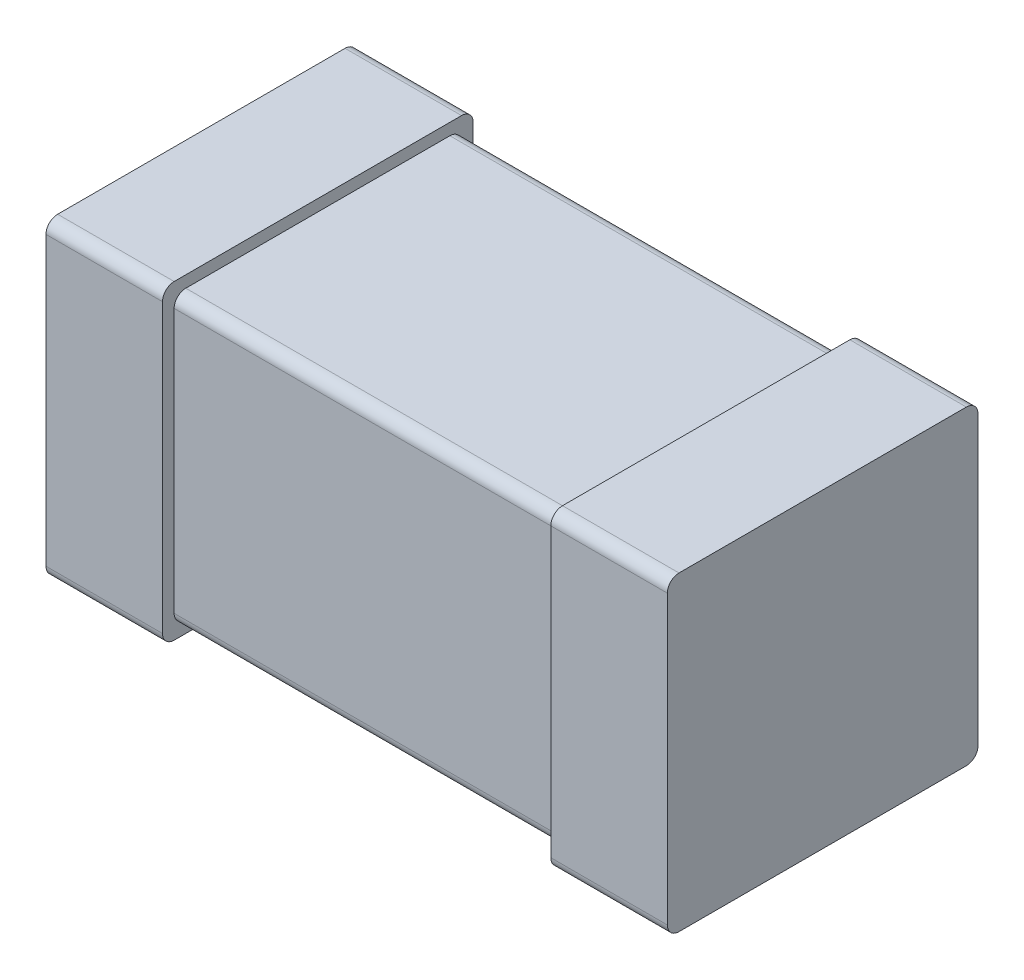
ISO-10303-21;
HEADER;
FILE_DESCRIPTION(('STEP AP214'),'2;1');
FILE_NAME('part.step','',(''),(''),'','','');
FILE_SCHEMA(('AUTOMOTIVE_DESIGN { 1 0 10303 214 1 1 1 1 }'));
ENDSEC;
DATA;
#1=APPLICATION_CONTEXT('core data for automotive mechanical design processes');
#2=APPLICATION_PROTOCOL_DEFINITION('international standard','automotive_design',2000,#1);
#3=PRODUCT_CONTEXT('',#1,'mechanical');
#4=PRODUCT('Part','Part','',(#3));
#5=PRODUCT_RELATED_PRODUCT_CATEGORY('part','',(#4));
#6=PRODUCT_DEFINITION_FORMATION('','',#4);
#7=PRODUCT_DEFINITION_CONTEXT('part definition',#1,'design');
#8=PRODUCT_DEFINITION('design','',#6,#7);
#9=PRODUCT_DEFINITION_SHAPE('','',#8);
#10=(LENGTH_UNIT() NAMED_UNIT(*) SI_UNIT(.MILLI.,.METRE.));
#11=(NAMED_UNIT(*) PLANE_ANGLE_UNIT() SI_UNIT($,.RADIAN.));
#12=(NAMED_UNIT(*) SI_UNIT($,.STERADIAN.) SOLID_ANGLE_UNIT());
#13=UNCERTAINTY_MEASURE_WITH_UNIT(LENGTH_MEASURE(1.E-05),#10,'distance_accuracy_value','');
#14=(GEOMETRIC_REPRESENTATION_CONTEXT(3) GLOBAL_UNCERTAINTY_ASSIGNED_CONTEXT((#13)) GLOBAL_UNIT_ASSIGNED_CONTEXT((#10,
#11,#12)) REPRESENTATION_CONTEXT('',''));
#15=CARTESIAN_POINT('',(0.,0.,0.));
#16=DIRECTION('',(0.,0.,1.));
#17=DIRECTION('',(1.,0.,0.));
#18=AXIS2_PLACEMENT_3D('',#15,#16,#17);
#19=CARTESIAN_POINT('',(0.8,-0.4,0.));
#20=DIRECTION('',(1.,0.,0.));
#21=DIRECTION('',(0.,1.,0.));
#22=AXIS2_PLACEMENT_3D('',#19,#20,#21);
#23=PLANE('',#22);
#24=DIRECTION('',(0.,0.,1.));
#25=VECTOR('',#24,1.);
#26=CARTESIAN_POINT('',(0.8,-0.4,0.));
#27=LINE('',#26,#25);
#28=CARTESIAN_POINT('',(0.8,-0.4,0.03));
#29=VERTEX_POINT('',#28);
#30=CARTESIAN_POINT('',(0.8,-0.4,0.77));
#31=VERTEX_POINT('',#30);
#32=EDGE_CURVE('E271',#29,#31,#27,.T.);
#33=ORIENTED_EDGE('',*,*,#32,.F.);
#34=CARTESIAN_POINT('',(0.8,-0.37,0.03));
#35=DIRECTION('',(1.,0.,0.));
#36=DIRECTION('',(0.,0.,1.));
#37=AXIS2_PLACEMENT_3D('',#34,#35,#36);
#38=CIRCLE('',#37,0.03);
#39=CARTESIAN_POINT('',(0.8,-0.37,0.));
#40=VERTEX_POINT('',#39);
#41=EDGE_CURVE('E248',#29,#40,#38,.T.);
#42=ORIENTED_EDGE('',*,*,#41,.T.);
#43=DIRECTION('',(0.,1.,0.));
#44=VECTOR('',#43,1.);
#45=CARTESIAN_POINT('',(0.8,-0.4,0.));
#46=LINE('',#45,#44);
#47=CARTESIAN_POINT('',(0.8,0.37,0.));
#48=VERTEX_POINT('',#47);
#49=EDGE_CURVE('E233',#40,#48,#46,.T.);
#50=ORIENTED_EDGE('',*,*,#49,.T.);
#51=CARTESIAN_POINT('',(0.8,0.37,0.03));
#52=DIRECTION('',(-1.,0.,0.));
#53=DIRECTION('',(0.,0.,1.));
#54=AXIS2_PLACEMENT_3D('',#51,#52,#53);
#55=CIRCLE('',#54,0.03);
#56=CARTESIAN_POINT('',(0.8,0.4,0.03));
#57=VERTEX_POINT('',#56);
#58=EDGE_CURVE('E277',#57,#48,#55,.T.);
#59=ORIENTED_EDGE('',*,*,#58,.F.);
#60=DIRECTION('',(0.,0.,1.));
#61=VECTOR('',#60,1.);
#62=CARTESIAN_POINT('',(0.8,0.4,0.));
#63=LINE('',#62,#61);
#64=CARTESIAN_POINT('',(0.8,0.4,0.77));
#65=VERTEX_POINT('',#64);
#66=EDGE_CURVE('E11',#57,#65,#63,.T.);
#67=ORIENTED_EDGE('',*,*,#66,.T.);
#68=CARTESIAN_POINT('',(0.8,0.37,0.77));
#69=DIRECTION('',(1.,0.,0.));
#70=DIRECTION('',(0.,0.,1.));
#71=AXIS2_PLACEMENT_3D('',#68,#69,#70);
#72=CIRCLE('',#71,0.03);
#73=CARTESIAN_POINT('',(0.8,0.37,0.8));
#74=VERTEX_POINT('',#73);
#75=EDGE_CURVE('E279',#65,#74,#72,.T.);
#76=ORIENTED_EDGE('',*,*,#75,.T.);
#77=DIRECTION('',(0.,1.,0.));
#78=VECTOR('',#77,1.);
#79=CARTESIAN_POINT('',(0.8,-0.4,0.8));
#80=LINE('',#79,#78);
#81=CARTESIAN_POINT('',(0.8,-0.37,0.8));
#82=VERTEX_POINT('',#81);
#83=EDGE_CURVE('E329',#82,#74,#80,.T.);
#84=ORIENTED_EDGE('',*,*,#83,.F.);
#85=CARTESIAN_POINT('',(0.8,-0.37,0.77));
#86=DIRECTION('',(-1.,0.,0.));
#87=DIRECTION('',(0.,0.,1.));
#88=AXIS2_PLACEMENT_3D('',#85,#86,#87);
#89=CIRCLE('',#88,0.03);
#90=EDGE_CURVE('E243',#31,#82,#89,.T.);
#91=ORIENTED_EDGE('',*,*,#90,.F.);
#92=EDGE_LOOP('',(#33,#42,#50,#59,#67,#76,#84,#91));
#93=FACE_BOUND('',#92,.T.);
#94=ADVANCED_FACE('F16',(#93),#23,.T.);
#95=CARTESIAN_POINT('',(0.5,0.4,0.));
#96=DIRECTION('',(0.,1.,0.));
#97=DIRECTION('',(1.,0.,0.));
#98=AXIS2_PLACEMENT_3D('',#95,#96,#97);
#99=PLANE('',#98);
#100=ORIENTED_EDGE('',*,*,#66,.F.);
#101=DIRECTION('',(1.,0.,0.));
#102=VECTOR('',#101,1.);
#103=CARTESIAN_POINT('',(0.5,0.4,0.03));
#104=LINE('',#103,#102);
#105=CARTESIAN_POINT('',(0.5,0.4,0.03));
#106=VERTEX_POINT('',#105);
#107=EDGE_CURVE('E280',#106,#57,#104,.T.);
#108=ORIENTED_EDGE('',*,*,#107,.F.);
#109=DIRECTION('',(0.,0.,1.));
#110=VECTOR('',#109,1.);
#111=CARTESIAN_POINT('',(0.5,0.4,0.));
#112=LINE('',#111,#110);
#113=CARTESIAN_POINT('',(0.5,0.4,0.77));
#114=VERTEX_POINT('',#113);
#115=EDGE_CURVE('E312',#106,#114,#112,.T.);
#116=ORIENTED_EDGE('',*,*,#115,.T.);
#117=DIRECTION('',(1.,0.,0.));
#118=VECTOR('',#117,1.);
#119=CARTESIAN_POINT('',(0.5,0.4,0.77));
#120=LINE('',#119,#118);
#121=EDGE_CURVE('E27',#114,#65,#120,.T.);
#122=ORIENTED_EDGE('',*,*,#121,.T.);
#123=EDGE_LOOP('',(#100,#108,#116,#122));
#124=FACE_BOUND('',#123,.T.);
#125=ADVANCED_FACE('F538',(#124),#99,.T.);
#126=CARTESIAN_POINT('',(0.5,0.37,0.77));
#127=DIRECTION('',(1.,0.,0.));
#128=DIRECTION('',(0.,1.,0.));
#129=AXIS2_PLACEMENT_3D('',#126,#127,#128);
#130=CYLINDRICAL_SURFACE('',#129,0.03);
#131=CARTESIAN_POINT('',(0.5,0.37,0.77));
#132=DIRECTION('',(1.,0.,0.));
#133=DIRECTION('',(0.,0.,1.));
#134=AXIS2_PLACEMENT_3D('',#131,#132,#133);
#135=CIRCLE('',#134,0.03);
#136=CARTESIAN_POINT('',(0.5,0.37,0.8));
#137=VERTEX_POINT('',#136);
#138=EDGE_CURVE('E430',#114,#137,#135,.T.);
#139=ORIENTED_EDGE('',*,*,#138,.T.);
#140=DIRECTION('',(1.,0.,0.));
#141=VECTOR('',#140,1.);
#142=CARTESIAN_POINT('',(0.5,0.37,0.8));
#143=LINE('',#142,#141);
#144=EDGE_CURVE('E325',#137,#74,#143,.T.);
#145=ORIENTED_EDGE('',*,*,#144,.T.);
#146=ORIENTED_EDGE('',*,*,#75,.F.);
#147=ORIENTED_EDGE('',*,*,#121,.F.);
#148=EDGE_LOOP('',(#139,#145,#146,#147));
#149=FACE_BOUND('',#148,.T.);
#150=ADVANCED_FACE('F541',(#149),#130,.T.);
#151=CARTESIAN_POINT('',(0.5,0.37,0.03));
#152=DIRECTION('',(1.,0.,0.));
#153=DIRECTION('',(0.,1.,0.));
#154=AXIS2_PLACEMENT_3D('',#151,#152,#153);
#155=CYLINDRICAL_SURFACE('',#154,0.03);
#156=ORIENTED_EDGE('',*,*,#107,.T.);
#157=ORIENTED_EDGE('',*,*,#58,.T.);
#158=DIRECTION('',(1.,0.,0.));
#159=VECTOR('',#158,1.);
#160=CARTESIAN_POINT('',(0.5,0.37,0.));
#161=LINE('',#160,#159);
#162=CARTESIAN_POINT('',(0.5,0.37,0.));
#163=VERTEX_POINT('',#162);
#164=EDGE_CURVE('E249',#163,#48,#161,.T.);
#165=ORIENTED_EDGE('',*,*,#164,.F.);
#166=CARTESIAN_POINT('',(0.5,0.37,0.03));
#167=DIRECTION('',(-1.,0.,0.));
#168=DIRECTION('',(0.,0.,1.));
#169=AXIS2_PLACEMENT_3D('',#166,#167,#168);
#170=CIRCLE('',#169,0.03);
#171=EDGE_CURVE('E270',#106,#163,#170,.T.);
#172=ORIENTED_EDGE('',*,*,#171,.F.);
#173=EDGE_LOOP('',(#156,#157,#165,#172));
#174=FACE_BOUND('',#173,.T.);
#175=ADVANCED_FACE('F535',(#174),#155,.T.);
#176=CARTESIAN_POINT('',(0.5,-0.4,0.8));
#177=DIRECTION('',(0.,0.,1.));
#178=DIRECTION('',(1.,0.,0.));
#179=AXIS2_PLACEMENT_3D('',#176,#177,#178);
#180=PLANE('',#179);
#181=DIRECTION('',(0.,1.,0.));
#182=VECTOR('',#181,1.);
#183=CARTESIAN_POINT('',(0.5,-0.4,0.8));
#184=LINE('',#183,#182);
#185=CARTESIAN_POINT('',(0.5,-0.37,0.8));
#186=VERTEX_POINT('',#185);
#187=EDGE_CURVE('E352',#186,#137,#184,.T.);
#188=ORIENTED_EDGE('',*,*,#187,.F.);
#189=DIRECTION('',(1.,0.,0.));
#190=VECTOR('',#189,1.);
#191=CARTESIAN_POINT('',(0.5,-0.37,0.8));
#192=LINE('',#191,#190);
#193=EDGE_CURVE('E247',#186,#82,#192,.T.);
#194=ORIENTED_EDGE('',*,*,#193,.T.);
#195=ORIENTED_EDGE('',*,*,#83,.T.);
#196=ORIENTED_EDGE('',*,*,#144,.F.);
#197=EDGE_LOOP('',(#188,#194,#195,#196));
#198=FACE_BOUND('',#197,.T.);
#199=ADVANCED_FACE('F543',(#198),#180,.T.);
#200=CARTESIAN_POINT('',(0.5,-0.4,0.));
#201=DIRECTION('',(0.,0.,1.));
#202=DIRECTION('',(1.,0.,0.));
#203=AXIS2_PLACEMENT_3D('',#200,#201,#202);
#204=PLANE('',#203);
#205=ORIENTED_EDGE('',*,*,#164,.T.);
#206=ORIENTED_EDGE('',*,*,#49,.F.);
#207=DIRECTION('',(1.,0.,0.));
#208=VECTOR('',#207,1.);
#209=CARTESIAN_POINT('',(0.5,-0.37,0.));
#210=LINE('',#209,#208);
#211=CARTESIAN_POINT('',(0.5,-0.37,0.));
#212=VERTEX_POINT('',#211);
#213=EDGE_CURVE('E275',#212,#40,#210,.T.);
#214=ORIENTED_EDGE('',*,*,#213,.F.);
#215=DIRECTION('',(0.,1.,0.));
#216=VECTOR('',#215,1.);
#217=CARTESIAN_POINT('',(0.5,-0.4,0.));
#218=LINE('',#217,#216);
#219=EDGE_CURVE('E265',#212,#163,#218,.T.);
#220=ORIENTED_EDGE('',*,*,#219,.T.);
#221=EDGE_LOOP('',(#205,#206,#214,#220));
#222=FACE_BOUND('',#221,.T.);
#223=ADVANCED_FACE('F532',(#222),#204,.F.);
#224=CARTESIAN_POINT('',(0.5,-0.37,0.77));
#225=DIRECTION('',(1.,0.,0.));
#226=DIRECTION('',(0.,-1.,0.));
#227=AXIS2_PLACEMENT_3D('',#224,#225,#226);
#228=CYLINDRICAL_SURFACE('',#227,0.03);
#229=DIRECTION('',(1.,0.,0.));
#230=VECTOR('',#229,1.);
#231=CARTESIAN_POINT('',(0.5,-0.4,0.77));
#232=LINE('',#231,#230);
#233=CARTESIAN_POINT('',(0.5,-0.4,0.77));
#234=VERTEX_POINT('',#233);
#235=EDGE_CURVE('E360',#234,#31,#232,.T.);
#236=ORIENTED_EDGE('',*,*,#235,.T.);
#237=ORIENTED_EDGE('',*,*,#90,.T.);
#238=ORIENTED_EDGE('',*,*,#193,.F.);
#239=CARTESIAN_POINT('',(0.5,-0.37,0.77));
#240=DIRECTION('',(-1.,0.,0.));
#241=DIRECTION('',(0.,0.,1.));
#242=AXIS2_PLACEMENT_3D('',#239,#240,#241);
#243=CIRCLE('',#242,0.03);
#244=EDGE_CURVE('E348',#234,#186,#243,.T.);
#245=ORIENTED_EDGE('',*,*,#244,.F.);
#246=EDGE_LOOP('',(#236,#237,#238,#245));
#247=FACE_BOUND('',#246,.T.);
#248=ADVANCED_FACE('F518',(#247),#228,.T.);
#249=CARTESIAN_POINT('',(0.5,-0.37,0.03));
#250=DIRECTION('',(1.,0.,0.));
#251=DIRECTION('',(0.,-1.,0.));
#252=AXIS2_PLACEMENT_3D('',#249,#250,#251);
#253=CYLINDRICAL_SURFACE('',#252,0.03);
#254=CARTESIAN_POINT('',(0.5,-0.37,0.03));
#255=DIRECTION('',(1.,0.,0.));
#256=DIRECTION('',(0.,0.,1.));
#257=AXIS2_PLACEMENT_3D('',#254,#255,#256);
#258=CIRCLE('',#257,0.03);
#259=CARTESIAN_POINT('',(0.5,-0.4,0.03));
#260=VERTEX_POINT('',#259);
#261=EDGE_CURVE('E269',#260,#212,#258,.T.);
#262=ORIENTED_EDGE('',*,*,#261,.T.);
#263=ORIENTED_EDGE('',*,*,#213,.T.);
#264=ORIENTED_EDGE('',*,*,#41,.F.);
#265=DIRECTION('',(1.,0.,0.));
#266=VECTOR('',#265,1.);
#267=CARTESIAN_POINT('',(0.5,-0.4,0.03));
#268=LINE('',#267,#266);
#269=EDGE_CURVE('E276',#260,#29,#268,.T.);
#270=ORIENTED_EDGE('',*,*,#269,.F.);
#271=EDGE_LOOP('',(#262,#263,#264,#270));
#272=FACE_BOUND('',#271,.T.);
#273=ADVANCED_FACE('F524',(#272),#253,.T.);
#274=CARTESIAN_POINT('',(0.5,-0.4,0.));
#275=DIRECTION('',(0.,1.,0.));
#276=DIRECTION('',(1.,0.,0.));
#277=AXIS2_PLACEMENT_3D('',#274,#275,#276);
#278=PLANE('',#277);
#279=ORIENTED_EDGE('',*,*,#235,.F.);
#280=DIRECTION('',(0.,0.,1.));
#281=VECTOR('',#280,1.);
#282=CARTESIAN_POINT('',(0.5,-0.4,0.));
#283=LINE('',#282,#281);
#284=EDGE_CURVE('E356',#260,#234,#283,.T.);
#285=ORIENTED_EDGE('',*,*,#284,.F.);
#286=ORIENTED_EDGE('',*,*,#269,.T.);
#287=ORIENTED_EDGE('',*,*,#32,.T.);
#288=EDGE_LOOP('',(#279,#285,#286,#287));
#289=FACE_BOUND('',#288,.T.);
#290=ADVANCED_FACE('F515',(#289),#278,.F.);
#291=CARTESIAN_POINT('',(0.5,-0.4,0.));
#292=DIRECTION('',(1.,0.,0.));
#293=DIRECTION('',(0.,1.,0.));
#294=AXIS2_PLACEMENT_3D('',#291,#292,#293);
#295=PLANE('',#294);
#296=DIRECTION('',(0.,1.,0.));
#297=VECTOR('',#296,1.);
#298=CARTESIAN_POINT('',(0.5,-0.37,0.03));
#299=LINE('',#298,#297);
#300=CARTESIAN_POINT('',(0.5,-0.34,0.03));
#301=VERTEX_POINT('',#300);
#302=CARTESIAN_POINT('',(0.5,0.34,0.03));
#303=VERTEX_POINT('',#302);
#304=EDGE_CURVE('E374',#301,#303,#299,.T.);
#305=ORIENTED_EDGE('',*,*,#304,.T.);
#306=CARTESIAN_POINT('',(0.5,0.34,0.06));
#307=DIRECTION('',(-1.,0.,0.));
#308=DIRECTION('',(0.,0.,1.));
#309=AXIS2_PLACEMENT_3D('',#306,#307,#308);
#310=CIRCLE('',#309,0.03);
#311=CARTESIAN_POINT('',(0.5,0.37,0.06));
#312=VERTEX_POINT('',#311);
#313=EDGE_CURVE('E340',#312,#303,#310,.T.);
#314=ORIENTED_EDGE('',*,*,#313,.F.);
#315=DIRECTION('',(0.,0.,1.));
#316=VECTOR('',#315,1.);
#317=CARTESIAN_POINT('',(0.5,0.37,0.03));
#318=LINE('',#317,#316);
#319=CARTESIAN_POINT('',(0.5,0.37,0.74));
#320=VERTEX_POINT('',#319);
#321=EDGE_CURVE('E343',#312,#320,#318,.T.);
#322=ORIENTED_EDGE('',*,*,#321,.T.);
#323=CARTESIAN_POINT('',(0.5,0.34,0.74));
#324=DIRECTION('',(1.,0.,0.));
#325=DIRECTION('',(0.,0.,1.));
#326=AXIS2_PLACEMENT_3D('',#323,#324,#325);
#327=CIRCLE('',#326,0.03);
#328=CARTESIAN_POINT('',(0.5,0.34,0.77));
#329=VERTEX_POINT('',#328);
#330=EDGE_CURVE('E257',#320,#329,#327,.T.);
#331=ORIENTED_EDGE('',*,*,#330,.T.);
#332=DIRECTION('',(0.,1.,0.));
#333=VECTOR('',#332,1.);
#334=CARTESIAN_POINT('',(0.5,-0.37,0.77));
#335=LINE('',#334,#333);
#336=CARTESIAN_POINT('',(0.5,-0.34,0.77));
#337=VERTEX_POINT('',#336);
#338=EDGE_CURVE('E320',#337,#329,#335,.T.);
#339=ORIENTED_EDGE('',*,*,#338,.F.);
#340=CARTESIAN_POINT('',(0.5,-0.34,0.74));
#341=DIRECTION('',(-1.,0.,0.));
#342=DIRECTION('',(0.,0.,1.));
#343=AXIS2_PLACEMENT_3D('',#340,#341,#342);
#344=CIRCLE('',#343,0.03);
#345=CARTESIAN_POINT('',(0.5,-0.37,0.74));
#346=VERTEX_POINT('',#345);
#347=EDGE_CURVE('E319',#346,#337,#344,.T.);
#348=ORIENTED_EDGE('',*,*,#347,.F.);
#349=DIRECTION('',(0.,0.,1.));
#350=VECTOR('',#349,1.);
#351=CARTESIAN_POINT('',(0.5,-0.37,0.03));
#352=LINE('',#351,#350);
#353=CARTESIAN_POINT('',(0.5,-0.37,0.06));
#354=VERTEX_POINT('',#353);
#355=EDGE_CURVE('E353',#354,#346,#352,.T.);
#356=ORIENTED_EDGE('',*,*,#355,.F.);
#357=CARTESIAN_POINT('',(0.5,-0.34,0.06));
#358=DIRECTION('',(1.,0.,0.));
#359=DIRECTION('',(0.,0.,1.));
#360=AXIS2_PLACEMENT_3D('',#357,#358,#359);
#361=CIRCLE('',#360,0.03);
#362=EDGE_CURVE('E264',#354,#301,#361,.T.);
#363=ORIENTED_EDGE('',*,*,#362,.T.);
#364=EDGE_LOOP('',(#305,#314,#322,#331,#339,#348,#356,#363));
#365=FACE_BOUND('',#364,.T.);
#366=ORIENTED_EDGE('',*,*,#244,.T.);
#367=ORIENTED_EDGE('',*,*,#187,.T.);
#368=ORIENTED_EDGE('',*,*,#138,.F.);
#369=ORIENTED_EDGE('',*,*,#115,.F.);
#370=ORIENTED_EDGE('',*,*,#171,.T.);
#371=ORIENTED_EDGE('',*,*,#219,.F.);
#372=ORIENTED_EDGE('',*,*,#261,.F.);
#373=ORIENTED_EDGE('',*,*,#284,.T.);
#374=EDGE_LOOP('',(#366,#367,#368,#369,#370,#371,#372,#373));
#375=FACE_BOUND('',#374,.T.);
#376=ADVANCED_FACE('F467',(#365,#375),#295,.F.);
#377=CARTESIAN_POINT('',(-0.5,-0.37,0.03));
#378=DIRECTION('',(0.,1.,0.));
#379=DIRECTION('',(1.,0.,0.));
#380=AXIS2_PLACEMENT_3D('',#377,#378,#379);
#381=PLANE('',#380);
#382=DIRECTION('',(1.,0.,0.));
#383=VECTOR('',#382,1.);
#384=CARTESIAN_POINT('',(-0.5,-0.37,0.74));
#385=LINE('',#384,#383);
#386=CARTESIAN_POINT('',(-0.5,-0.37,0.74));
#387=VERTEX_POINT('',#386);
#388=EDGE_CURVE('E315',#387,#346,#385,.T.);
#389=ORIENTED_EDGE('',*,*,#388,.F.);
#390=DIRECTION('',(0.,0.,1.));
#391=VECTOR('',#390,1.);
#392=CARTESIAN_POINT('',(-0.5,-0.37,0.03));
#393=LINE('',#392,#391);
#394=CARTESIAN_POINT('',(-0.5,-0.37,0.06));
#395=VERTEX_POINT('',#394);
#396=EDGE_CURVE('E370',#395,#387,#393,.T.);
#397=ORIENTED_EDGE('',*,*,#396,.F.);
#398=DIRECTION('',(1.,0.,0.));
#399=VECTOR('',#398,1.);
#400=CARTESIAN_POINT('',(-0.5,-0.37,0.06));
#401=LINE('',#400,#399);
#402=EDGE_CURVE('E259',#395,#354,#401,.T.);
#403=ORIENTED_EDGE('',*,*,#402,.T.);
#404=ORIENTED_EDGE('',*,*,#355,.T.);
#405=EDGE_LOOP('',(#389,#397,#403,#404));
#406=FACE_BOUND('',#405,.T.);
#407=ADVANCED_FACE('F584',(#406),#381,.F.);
#408=CARTESIAN_POINT('',(-0.5,-0.34,0.74));
#409=DIRECTION('',(1.,0.,0.));
#410=DIRECTION('',(0.,-1.,0.));
#411=AXIS2_PLACEMENT_3D('',#408,#409,#410);
#412=CYLINDRICAL_SURFACE('',#411,0.03);
#413=ORIENTED_EDGE('',*,*,#388,.T.);
#414=ORIENTED_EDGE('',*,*,#347,.T.);
#415=DIRECTION('',(1.,0.,0.));
#416=VECTOR('',#415,1.);
#417=CARTESIAN_POINT('',(-0.5,-0.34,0.77));
#418=LINE('',#417,#416);
#419=CARTESIAN_POINT('',(-0.5,-0.34,0.77));
#420=VERTEX_POINT('',#419);
#421=EDGE_CURVE('E437',#420,#337,#418,.T.);
#422=ORIENTED_EDGE('',*,*,#421,.F.);
#423=CARTESIAN_POINT('',(-0.5,-0.34,0.74));
#424=DIRECTION('',(-1.,0.,0.));
#425=DIRECTION('',(0.,0.,1.));
#426=AXIS2_PLACEMENT_3D('',#423,#424,#425);
#427=CIRCLE('',#426,0.03);
#428=EDGE_CURVE('E324',#387,#420,#427,.T.);
#429=ORIENTED_EDGE('',*,*,#428,.F.);
#430=EDGE_LOOP('',(#413,#414,#422,#429));
#431=FACE_BOUND('',#430,.T.);
#432=ADVANCED_FACE('F586',(#431),#412,.T.);
#433=CARTESIAN_POINT('',(-0.5,-0.37,0.77));
#434=DIRECTION('',(0.,0.,1.));
#435=DIRECTION('',(1.,0.,0.));
#436=AXIS2_PLACEMENT_3D('',#433,#434,#435);
#437=PLANE('',#436);
#438=DIRECTION('',(0.,1.,0.));
#439=VECTOR('',#438,1.);
#440=CARTESIAN_POINT('',(-0.5,-0.37,0.77));
#441=LINE('',#440,#439);
#442=CARTESIAN_POINT('',(-0.5,0.34,0.77));
#443=VERTEX_POINT('',#442);
#444=EDGE_CURVE('E292',#420,#443,#441,.T.);
#445=ORIENTED_EDGE('',*,*,#444,.F.);
#446=ORIENTED_EDGE('',*,*,#421,.T.);
#447=ORIENTED_EDGE('',*,*,#338,.T.);
#448=DIRECTION('',(1.,0.,0.));
#449=VECTOR('',#448,1.);
#450=CARTESIAN_POINT('',(-0.5,0.34,0.77));
#451=LINE('',#450,#449);
#452=EDGE_CURVE('E253',#443,#329,#451,.T.);
#453=ORIENTED_EDGE('',*,*,#452,.F.);
#454=EDGE_LOOP('',(#445,#446,#447,#453));
#455=FACE_BOUND('',#454,.T.);
#456=ADVANCED_FACE('F479',(#455),#437,.T.);
#457=CARTESIAN_POINT('',(-0.5,0.34,0.74));
#458=DIRECTION('',(1.,0.,0.));
#459=DIRECTION('',(0.,1.,0.));
#460=AXIS2_PLACEMENT_3D('',#457,#458,#459);
#461=CYLINDRICAL_SURFACE('',#460,0.03);
#462=CARTESIAN_POINT('',(-0.5,0.34,0.74));
#463=DIRECTION('',(1.,0.,0.));
#464=DIRECTION('',(0.,0.,1.));
#465=AXIS2_PLACEMENT_3D('',#462,#463,#464);
#466=CIRCLE('',#465,0.03);
#467=CARTESIAN_POINT('',(-0.5,0.37,0.74));
#468=VERTEX_POINT('',#467);
#469=EDGE_CURVE('E287',#468,#443,#466,.T.);
#470=ORIENTED_EDGE('',*,*,#469,.T.);
#471=ORIENTED_EDGE('',*,*,#452,.T.);
#472=ORIENTED_EDGE('',*,*,#330,.F.);
#473=DIRECTION('',(1.,0.,0.));
#474=VECTOR('',#473,1.);
#475=CARTESIAN_POINT('',(-0.5,0.37,0.74));
#476=LINE('',#475,#474);
#477=EDGE_CURVE('E258',#468,#320,#476,.T.);
#478=ORIENTED_EDGE('',*,*,#477,.F.);
#479=EDGE_LOOP('',(#470,#471,#472,#478));
#480=FACE_BOUND('',#479,.T.);
#481=ADVANCED_FACE('F475',(#480),#461,.T.);
#482=CARTESIAN_POINT('',(-0.5,0.37,0.03));
#483=DIRECTION('',(0.,1.,0.));
#484=DIRECTION('',(1.,0.,0.));
#485=AXIS2_PLACEMENT_3D('',#482,#483,#484);
#486=PLANE('',#485);
#487=ORIENTED_EDGE('',*,*,#321,.F.);
#488=DIRECTION('',(1.,0.,0.));
#489=VECTOR('',#488,1.);
#490=CARTESIAN_POINT('',(-0.5,0.37,0.06));
#491=LINE('',#490,#489);
#492=CARTESIAN_POINT('',(-0.5,0.37,0.06));
#493=VERTEX_POINT('',#492);
#494=EDGE_CURVE('E344',#493,#312,#491,.T.);
#495=ORIENTED_EDGE('',*,*,#494,.F.);
#496=DIRECTION('',(0.,0.,1.));
#497=VECTOR('',#496,1.);
#498=CARTESIAN_POINT('',(-0.5,0.37,0.03));
#499=LINE('',#498,#497);
#500=EDGE_CURVE('E291',#493,#468,#499,.T.);
#501=ORIENTED_EDGE('',*,*,#500,.T.);
#502=ORIENTED_EDGE('',*,*,#477,.T.);
#503=EDGE_LOOP('',(#487,#495,#501,#502));
#504=FACE_BOUND('',#503,.T.);
#505=ADVANCED_FACE('F596',(#504),#486,.T.);
#506=CARTESIAN_POINT('',(-0.5,0.34,0.06));
#507=DIRECTION('',(1.,0.,0.));
#508=DIRECTION('',(0.,1.,0.));
#509=AXIS2_PLACEMENT_3D('',#506,#507,#508);
#510=CYLINDRICAL_SURFACE('',#509,0.03);
#511=ORIENTED_EDGE('',*,*,#494,.T.);
#512=ORIENTED_EDGE('',*,*,#313,.T.);
#513=DIRECTION('',(1.,0.,0.));
#514=VECTOR('',#513,1.);
#515=CARTESIAN_POINT('',(-0.5,0.34,0.03));
#516=LINE('',#515,#514);
#517=CARTESIAN_POINT('',(-0.5,0.34,0.03));
#518=VERTEX_POINT('',#517);
#519=EDGE_CURVE('E263',#518,#303,#516,.T.);
#520=ORIENTED_EDGE('',*,*,#519,.F.);
#521=CARTESIAN_POINT('',(-0.5,0.34,0.06));
#522=DIRECTION('',(-1.,0.,0.));
#523=DIRECTION('',(0.,0.,1.));
#524=AXIS2_PLACEMENT_3D('',#521,#522,#523);
#525=CIRCLE('',#524,0.03);
#526=EDGE_CURVE('E298',#493,#518,#525,.T.);
#527=ORIENTED_EDGE('',*,*,#526,.F.);
#528=EDGE_LOOP('',(#511,#512,#520,#527));
#529=FACE_BOUND('',#528,.T.);
#530=ADVANCED_FACE('F578',(#529),#510,.T.);
#531=CARTESIAN_POINT('',(-0.5,-0.37,0.03));
#532=DIRECTION('',(0.,0.,1.));
#533=DIRECTION('',(1.,0.,0.));
#534=AXIS2_PLACEMENT_3D('',#531,#532,#533);
#535=PLANE('',#534);
#536=ORIENTED_EDGE('',*,*,#519,.T.);
#537=ORIENTED_EDGE('',*,*,#304,.F.);
#538=DIRECTION('',(1.,0.,0.));
#539=VECTOR('',#538,1.);
#540=CARTESIAN_POINT('',(-0.5,-0.34,0.03));
#541=LINE('',#540,#539);
#542=CARTESIAN_POINT('',(-0.5,-0.34,0.03));
#543=VERTEX_POINT('',#542);
#544=EDGE_CURVE('E297',#543,#301,#541,.T.);
#545=ORIENTED_EDGE('',*,*,#544,.F.);
#546=DIRECTION('',(0.,1.,0.));
#547=VECTOR('',#546,1.);
#548=CARTESIAN_POINT('',(-0.5,-0.37,0.03));
#549=LINE('',#548,#547);
#550=EDGE_CURVE('E293',#543,#518,#549,.T.);
#551=ORIENTED_EDGE('',*,*,#550,.T.);
#552=EDGE_LOOP('',(#536,#537,#545,#551));
#553=FACE_BOUND('',#552,.T.);
#554=ADVANCED_FACE('F574',(#553),#535,.F.);
#555=CARTESIAN_POINT('',(-0.5,-0.34,0.06));
#556=DIRECTION('',(1.,0.,0.));
#557=DIRECTION('',(0.,-1.,0.));
#558=AXIS2_PLACEMENT_3D('',#555,#556,#557);
#559=CYLINDRICAL_SURFACE('',#558,0.03);
#560=CARTESIAN_POINT('',(-0.5,-0.34,0.06));
#561=DIRECTION('',(1.,0.,0.));
#562=DIRECTION('',(0.,0.,1.));
#563=AXIS2_PLACEMENT_3D('',#560,#561,#562);
#564=CIRCLE('',#563,0.03);
#565=EDGE_CURVE('E378',#395,#543,#564,.T.);
#566=ORIENTED_EDGE('',*,*,#565,.T.);
#567=ORIENTED_EDGE('',*,*,#544,.T.);
#568=ORIENTED_EDGE('',*,*,#362,.F.);
#569=ORIENTED_EDGE('',*,*,#402,.F.);
#570=EDGE_LOOP('',(#566,#567,#568,#569));
#571=FACE_BOUND('',#570,.T.);
#572=ADVANCED_FACE('F577',(#571),#559,.T.);
#573=CARTESIAN_POINT('',(-0.5,-0.4,0.));
#574=DIRECTION('',(1.,0.,0.));
#575=DIRECTION('',(0.,1.,0.));
#576=AXIS2_PLACEMENT_3D('',#573,#574,#575);
#577=PLANE('',#576);
#578=ORIENTED_EDGE('',*,*,#565,.F.);
#579=ORIENTED_EDGE('',*,*,#396,.T.);
#580=ORIENTED_EDGE('',*,*,#428,.T.);
#581=ORIENTED_EDGE('',*,*,#444,.T.);
#582=ORIENTED_EDGE('',*,*,#469,.F.);
#583=ORIENTED_EDGE('',*,*,#500,.F.);
#584=ORIENTED_EDGE('',*,*,#526,.T.);
#585=ORIENTED_EDGE('',*,*,#550,.F.);
#586=EDGE_LOOP('',(#578,#579,#580,#581,#582,#583,#584,#585));
#587=FACE_BOUND('',#586,.T.);
#588=DIRECTION('',(0.,0.,1.));
#589=VECTOR('',#588,1.);
#590=CARTESIAN_POINT('',(-0.5,-0.4,0.));
#591=LINE('',#590,#589);
#592=CARTESIAN_POINT('',(-0.5,-0.4,0.03));
#593=VERTEX_POINT('',#592);
#594=CARTESIAN_POINT('',(-0.5,-0.4,0.77));
#595=VERTEX_POINT('',#594);
#596=EDGE_CURVE('E195',#593,#595,#591,.T.);
#597=ORIENTED_EDGE('',*,*,#596,.F.);
#598=CARTESIAN_POINT('',(-0.5,-0.37,0.03));
#599=DIRECTION('',(1.,0.,0.));
#600=DIRECTION('',(0.,0.,1.));
#601=AXIS2_PLACEMENT_3D('',#598,#599,#600);
#602=CIRCLE('',#601,0.03);
#603=CARTESIAN_POINT('',(-0.5,-0.37,0.));
#604=VERTEX_POINT('',#603);
#605=EDGE_CURVE('E205',#593,#604,#602,.T.);
#606=ORIENTED_EDGE('',*,*,#605,.T.);
#607=DIRECTION('',(0.,1.,0.));
#608=VECTOR('',#607,1.);
#609=CARTESIAN_POINT('',(-0.5,-0.4,0.));
#610=LINE('',#609,#608);
#611=CARTESIAN_POINT('',(-0.5,0.37,0.));
#612=VERTEX_POINT('',#611);
#613=EDGE_CURVE('E407',#604,#612,#610,.T.);
#614=ORIENTED_EDGE('',*,*,#613,.T.);
#615=CARTESIAN_POINT('',(-0.5,0.37,0.03));
#616=DIRECTION('',(-1.,0.,0.));
#617=DIRECTION('',(0.,0.,1.));
#618=AXIS2_PLACEMENT_3D('',#615,#616,#617);
#619=CIRCLE('',#618,0.03);
#620=CARTESIAN_POINT('',(-0.5,0.4,0.03));
#621=VERTEX_POINT('',#620);
#622=EDGE_CURVE('E238',#621,#612,#619,.T.);
#623=ORIENTED_EDGE('',*,*,#622,.F.);
#624=DIRECTION('',(0.,0.,1.));
#625=VECTOR('',#624,1.);
#626=CARTESIAN_POINT('',(-0.5,0.4,0.));
#627=LINE('',#626,#625);
#628=CARTESIAN_POINT('',(-0.5,0.4,0.77));
#629=VERTEX_POINT('',#628);
#630=EDGE_CURVE('E306',#621,#629,#627,.T.);
#631=ORIENTED_EDGE('',*,*,#630,.T.);
#632=CARTESIAN_POINT('',(-0.5,0.37,0.77));
#633=DIRECTION('',(1.,0.,0.));
#634=DIRECTION('',(0.,0.,1.));
#635=AXIS2_PLACEMENT_3D('',#632,#633,#634);
#636=CIRCLE('',#635,0.03);
#637=CARTESIAN_POINT('',(-0.5,0.37,0.8));
#638=VERTEX_POINT('',#637);
#639=EDGE_CURVE('E242',#629,#638,#636,.T.);
#640=ORIENTED_EDGE('',*,*,#639,.T.);
#641=DIRECTION('',(0.,1.,0.));
#642=VECTOR('',#641,1.);
#643=CARTESIAN_POINT('',(-0.5,-0.4,0.8));
#644=LINE('',#643,#642);
#645=CARTESIAN_POINT('',(-0.5,-0.37,0.8));
#646=VERTEX_POINT('',#645);
#647=EDGE_CURVE('E198',#646,#638,#644,.T.);
#648=ORIENTED_EDGE('',*,*,#647,.F.);
#649=CARTESIAN_POINT('',(-0.5,-0.37,0.77));
#650=DIRECTION('',(-1.,0.,0.));
#651=DIRECTION('',(0.,0.,1.));
#652=AXIS2_PLACEMENT_3D('',#649,#650,#651);
#653=CIRCLE('',#652,0.03);
#654=EDGE_CURVE('E191',#595,#646,#653,.T.);
#655=ORIENTED_EDGE('',*,*,#654,.F.);
#656=EDGE_LOOP('',(#597,#606,#614,#623,#631,#640,#648,#655));
#657=FACE_BOUND('',#656,.T.);
#658=ADVANCED_FACE('F193',(#587,#657),#577,.T.);
#659=CARTESIAN_POINT('',(-0.8,0.4,0.));
#660=DIRECTION('',(0.,1.,0.));
#661=DIRECTION('',(1.,0.,0.));
#662=AXIS2_PLACEMENT_3D('',#659,#660,#661);
#663=PLANE('',#662);
#664=ORIENTED_EDGE('',*,*,#630,.F.);
#665=DIRECTION('',(1.,0.,0.));
#666=VECTOR('',#665,1.);
#667=CARTESIAN_POINT('',(-0.8,0.4,0.03));
#668=LINE('',#667,#666);
#669=CARTESIAN_POINT('',(-0.8,0.4,0.03));
#670=VERTEX_POINT('',#669);
#671=EDGE_CURVE('E235',#670,#621,#668,.T.);
#672=ORIENTED_EDGE('',*,*,#671,.F.);
#673=DIRECTION('',(0.,0.,1.));
#674=VECTOR('',#673,1.);
#675=CARTESIAN_POINT('',(-0.8,0.4,0.));
#676=LINE('',#675,#674);
#677=CARTESIAN_POINT('',(-0.8,0.4,0.77));
#678=VERTEX_POINT('',#677);
#679=EDGE_CURVE('E286',#670,#678,#676,.T.);
#680=ORIENTED_EDGE('',*,*,#679,.T.);
#681=DIRECTION('',(1.,0.,0.));
#682=VECTOR('',#681,1.);
#683=CARTESIAN_POINT('',(-0.8,0.4,0.77));
#684=LINE('',#683,#682);
#685=EDGE_CURVE('E302',#678,#629,#684,.T.);
#686=ORIENTED_EDGE('',*,*,#685,.T.);
#687=EDGE_LOOP('',(#664,#672,#680,#686));
#688=FACE_BOUND('',#687,.T.);
#689=ADVANCED_FACE('F18',(#688),#663,.T.);
#690=CARTESIAN_POINT('',(-0.8,0.37,0.77));
#691=DIRECTION('',(1.,0.,0.));
#692=DIRECTION('',(0.,1.,0.));
#693=AXIS2_PLACEMENT_3D('',#690,#691,#692);
#694=CYLINDRICAL_SURFACE('',#693,0.03);
#695=CARTESIAN_POINT('',(-0.8,0.37,0.77));
#696=DIRECTION('',(1.,0.,0.));
#697=DIRECTION('',(0.,0.,1.));
#698=AXIS2_PLACEMENT_3D('',#695,#696,#697);
#699=CIRCLE('',#698,0.03);
#700=CARTESIAN_POINT('',(-0.8,0.37,0.8));
#701=VERTEX_POINT('',#700);
#702=EDGE_CURVE('E335',#678,#701,#699,.T.);
#703=ORIENTED_EDGE('',*,*,#702,.T.);
#704=DIRECTION('',(1.,0.,0.));
#705=VECTOR('',#704,1.);
#706=CARTESIAN_POINT('',(-0.8,0.37,0.8));
#707=LINE('',#706,#705);
#708=EDGE_CURVE('E239',#701,#638,#707,.T.);
#709=ORIENTED_EDGE('',*,*,#708,.T.);
#710=ORIENTED_EDGE('',*,*,#639,.F.);
#711=ORIENTED_EDGE('',*,*,#685,.F.);
#712=EDGE_LOOP('',(#703,#709,#710,#711));
#713=FACE_BOUND('',#712,.T.);
#714=ADVANCED_FACE('F572',(#713),#694,.T.);
#715=CARTESIAN_POINT('',(-0.8,0.37,0.03));
#716=DIRECTION('',(1.,0.,0.));
#717=DIRECTION('',(0.,1.,0.));
#718=AXIS2_PLACEMENT_3D('',#715,#716,#717);
#719=CYLINDRICAL_SURFACE('',#718,0.03);
#720=ORIENTED_EDGE('',*,*,#671,.T.);
#721=ORIENTED_EDGE('',*,*,#622,.T.);
#722=DIRECTION('',(1.,0.,0.));
#723=VECTOR('',#722,1.);
#724=CARTESIAN_POINT('',(-0.8,0.37,0.));
#725=LINE('',#724,#723);
#726=CARTESIAN_POINT('',(-0.8,0.37,0.));
#727=VERTEX_POINT('',#726);
#728=EDGE_CURVE('E403',#727,#612,#725,.T.);
#729=ORIENTED_EDGE('',*,*,#728,.F.);
#730=CARTESIAN_POINT('',(-0.8,0.37,0.03));
#731=DIRECTION('',(-1.,0.,0.));
#732=DIRECTION('',(0.,0.,1.));
#733=AXIS2_PLACEMENT_3D('',#730,#731,#732);
#734=CIRCLE('',#733,0.03);
#735=EDGE_CURVE('E282',#670,#727,#734,.T.);
#736=ORIENTED_EDGE('',*,*,#735,.F.);
#737=EDGE_LOOP('',(#720,#721,#729,#736));
#738=FACE_BOUND('',#737,.T.);
#739=ADVANCED_FACE('F565',(#738),#719,.T.);
#740=CARTESIAN_POINT('',(-0.8,-0.4,0.8));
#741=DIRECTION('',(0.,0.,1.));
#742=DIRECTION('',(1.,0.,0.));
#743=AXIS2_PLACEMENT_3D('',#740,#741,#742);
#744=PLANE('',#743);
#745=DIRECTION('',(0.,1.,0.));
#746=VECTOR('',#745,1.);
#747=CARTESIAN_POINT('',(-0.8,-0.4,0.8));
#748=LINE('',#747,#746);
#749=CARTESIAN_POINT('',(-0.8,-0.37,0.8));
#750=VERTEX_POINT('',#749);
#751=EDGE_CURVE('E388',#750,#701,#748,.T.);
#752=ORIENTED_EDGE('',*,*,#751,.F.);
#753=DIRECTION('',(1.,0.,0.));
#754=VECTOR('',#753,1.);
#755=CARTESIAN_POINT('',(-0.8,-0.37,0.8));
#756=LINE('',#755,#754);
#757=EDGE_CURVE('E204',#750,#646,#756,.T.);
#758=ORIENTED_EDGE('',*,*,#757,.T.);
#759=ORIENTED_EDGE('',*,*,#647,.T.);
#760=ORIENTED_EDGE('',*,*,#708,.F.);
#761=EDGE_LOOP('',(#752,#758,#759,#760));
#762=FACE_BOUND('',#761,.T.);
#763=ADVANCED_FACE('F561',(#762),#744,.T.);
#764=CARTESIAN_POINT('',(-0.8,-0.4,0.));
#765=DIRECTION('',(0.,0.,1.));
#766=DIRECTION('',(1.,0.,0.));
#767=AXIS2_PLACEMENT_3D('',#764,#765,#766);
#768=PLANE('',#767);
#769=ORIENTED_EDGE('',*,*,#728,.T.);
#770=ORIENTED_EDGE('',*,*,#613,.F.);
#771=DIRECTION('',(1.,0.,0.));
#772=VECTOR('',#771,1.);
#773=CARTESIAN_POINT('',(-0.8,-0.37,0.));
#774=LINE('',#773,#772);
#775=CARTESIAN_POINT('',(-0.8,-0.37,0.));
#776=VERTEX_POINT('',#775);
#777=EDGE_CURVE('E214',#776,#604,#774,.T.);
#778=ORIENTED_EDGE('',*,*,#777,.F.);
#779=DIRECTION('',(0.,1.,0.));
#780=VECTOR('',#779,1.);
#781=CARTESIAN_POINT('',(-0.8,-0.4,0.));
#782=LINE('',#781,#780);
#783=EDGE_CURVE('E20',#776,#727,#782,.T.);
#784=ORIENTED_EDGE('',*,*,#783,.T.);
#785=EDGE_LOOP('',(#769,#770,#778,#784));
#786=FACE_BOUND('',#785,.T.);
#787=ADVANCED_FACE('F564',(#786),#768,.F.);
#788=CARTESIAN_POINT('',(-0.8,-0.37,0.77));
#789=DIRECTION('',(1.,0.,0.));
#790=DIRECTION('',(0.,-1.,0.));
#791=AXIS2_PLACEMENT_3D('',#788,#789,#790);
#792=CYLINDRICAL_SURFACE('',#791,0.03);
#793=DIRECTION('',(1.,0.,0.));
#794=VECTOR('',#793,1.);
#795=CARTESIAN_POINT('',(-0.8,-0.4,0.77));
#796=LINE('',#795,#794);
#797=CARTESIAN_POINT('',(-0.8,-0.4,0.77));
#798=VERTEX_POINT('',#797);
#799=EDGE_CURVE('E210',#798,#595,#796,.T.);
#800=ORIENTED_EDGE('',*,*,#799,.T.);
#801=ORIENTED_EDGE('',*,*,#654,.T.);
#802=ORIENTED_EDGE('',*,*,#757,.F.);
#803=CARTESIAN_POINT('',(-0.8,-0.37,0.77));
#804=DIRECTION('',(-1.,0.,0.));
#805=DIRECTION('',(0.,0.,1.));
#806=AXIS2_PLACEMENT_3D('',#803,#804,#805);
#807=CIRCLE('',#806,0.03);
#808=EDGE_CURVE('E219',#798,#750,#807,.T.);
#809=ORIENTED_EDGE('',*,*,#808,.F.);
#810=EDGE_LOOP('',(#800,#801,#802,#809));
#811=FACE_BOUND('',#810,.T.);
#812=ADVANCED_FACE('F217',(#811),#792,.T.);
#813=CARTESIAN_POINT('',(-0.8,-0.37,0.03));
#814=DIRECTION('',(1.,0.,0.));
#815=DIRECTION('',(0.,-1.,0.));
#816=AXIS2_PLACEMENT_3D('',#813,#814,#815);
#817=CYLINDRICAL_SURFACE('',#816,0.03);
#818=CARTESIAN_POINT('',(-0.8,-0.37,0.03));
#819=DIRECTION('',(1.,0.,0.));
#820=DIRECTION('',(0.,0.,1.));
#821=AXIS2_PLACEMENT_3D('',#818,#819,#820);
#822=CIRCLE('',#821,0.03);
#823=CARTESIAN_POINT('',(-0.8,-0.4,0.03));
#824=VERTEX_POINT('',#823);
#825=EDGE_CURVE('E229',#824,#776,#822,.T.);
#826=ORIENTED_EDGE('',*,*,#825,.T.);
#827=ORIENTED_EDGE('',*,*,#777,.T.);
#828=ORIENTED_EDGE('',*,*,#605,.F.);
#829=DIRECTION('',(1.,0.,0.));
#830=VECTOR('',#829,1.);
#831=CARTESIAN_POINT('',(-0.8,-0.4,0.03));
#832=LINE('',#831,#830);
#833=EDGE_CURVE('E212',#824,#593,#832,.T.);
#834=ORIENTED_EDGE('',*,*,#833,.F.);
#835=EDGE_LOOP('',(#826,#827,#828,#834));
#836=FACE_BOUND('',#835,.T.);
#837=ADVANCED_FACE('F589',(#836),#817,.T.);
#838=CARTESIAN_POINT('',(-0.8,-0.4,0.));
#839=DIRECTION('',(0.,1.,0.));
#840=DIRECTION('',(1.,0.,0.));
#841=AXIS2_PLACEMENT_3D('',#838,#839,#840);
#842=PLANE('',#841);
#843=ORIENTED_EDGE('',*,*,#799,.F.);
#844=DIRECTION('',(0.,0.,1.));
#845=VECTOR('',#844,1.);
#846=CARTESIAN_POINT('',(-0.8,-0.4,0.));
#847=LINE('',#846,#845);
#848=EDGE_CURVE('E221',#824,#798,#847,.T.);
#849=ORIENTED_EDGE('',*,*,#848,.F.);
#850=ORIENTED_EDGE('',*,*,#833,.T.);
#851=ORIENTED_EDGE('',*,*,#596,.T.);
#852=EDGE_LOOP('',(#843,#849,#850,#851));
#853=FACE_BOUND('',#852,.T.);
#854=ADVANCED_FACE('F208',(#853),#842,.F.);
#855=CARTESIAN_POINT('',(-0.8,-0.4,0.));
#856=DIRECTION('',(1.,0.,0.));
#857=DIRECTION('',(0.,1.,0.));
#858=AXIS2_PLACEMENT_3D('',#855,#856,#857);
#859=PLANE('',#858);
#860=ORIENTED_EDGE('',*,*,#808,.T.);
#861=ORIENTED_EDGE('',*,*,#751,.T.);
#862=ORIENTED_EDGE('',*,*,#702,.F.);
#863=ORIENTED_EDGE('',*,*,#679,.F.);
#864=ORIENTED_EDGE('',*,*,#735,.T.);
#865=ORIENTED_EDGE('',*,*,#783,.F.);
#866=ORIENTED_EDGE('',*,*,#825,.F.);
#867=ORIENTED_EDGE('',*,*,#848,.T.);
#868=EDGE_LOOP('',(#860,#861,#862,#863,#864,#865,#866,#867));
#869=FACE_BOUND('',#868,.T.);
#870=ADVANCED_FACE('F593',(#869),#859,.F.);
#871=CLOSED_SHELL('',(#94,#125,#150,#175,#199,#223,#248,#273,#290,#376,#407,#432,#456,#481,#505,
#530,#554,#572,#658,#689,#714,#739,#763,#787,#812,#837,#854,#870));
#872=MANIFOLD_SOLID_BREP('B1',#871);
#873=ADVANCED_BREP_SHAPE_REPRESENTATION('',(#18,#872),#14);
#874=SHAPE_DEFINITION_REPRESENTATION(#9,#873);
ENDSEC;
END-ISO-10303-21;
